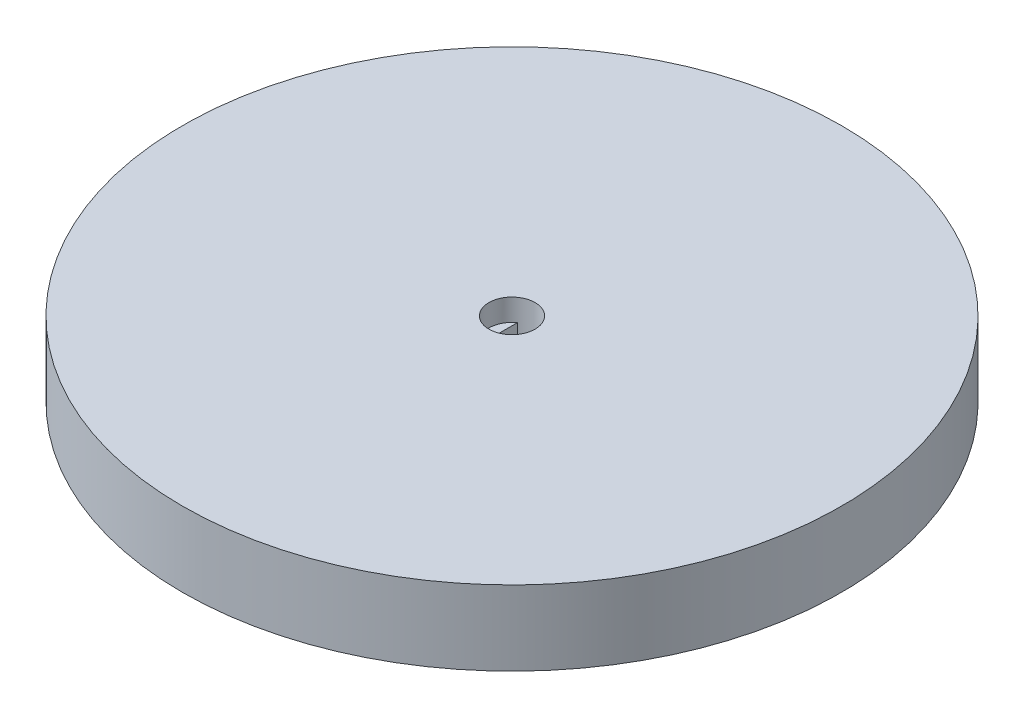
ISO-10303-21;
HEADER;
FILE_DESCRIPTION(('STEP AP214'),'2;1');
FILE_NAME('part.step','',(''),(''),'','','');
FILE_SCHEMA(('AUTOMOTIVE_DESIGN { 1 0 10303 214 1 1 1 1 }'));
ENDSEC;
DATA;
#1=APPLICATION_CONTEXT('core data for automotive mechanical design processes');
#2=APPLICATION_PROTOCOL_DEFINITION('international standard','automotive_design',2000,#1);
#3=PRODUCT_CONTEXT('',#1,'mechanical');
#4=PRODUCT('Part','Part','',(#3));
#5=PRODUCT_RELATED_PRODUCT_CATEGORY('part','',(#4));
#6=PRODUCT_DEFINITION_FORMATION('','',#4);
#7=PRODUCT_DEFINITION_CONTEXT('part definition',#1,'design');
#8=PRODUCT_DEFINITION('design','',#6,#7);
#9=PRODUCT_DEFINITION_SHAPE('','',#8);
#10=(LENGTH_UNIT() NAMED_UNIT(*) SI_UNIT(.MILLI.,.METRE.));
#11=(NAMED_UNIT(*) PLANE_ANGLE_UNIT() SI_UNIT($,.RADIAN.));
#12=(NAMED_UNIT(*) SI_UNIT($,.STERADIAN.) SOLID_ANGLE_UNIT());
#13=UNCERTAINTY_MEASURE_WITH_UNIT(LENGTH_MEASURE(1.E-05),#10,'distance_accuracy_value','');
#14=(GEOMETRIC_REPRESENTATION_CONTEXT(3) GLOBAL_UNCERTAINTY_ASSIGNED_CONTEXT((#13)) GLOBAL_UNIT_ASSIGNED_CONTEXT((#10,
#11,#12)) REPRESENTATION_CONTEXT('',''));
#15=CARTESIAN_POINT('',(0.,0.,0.));
#16=DIRECTION('',(0.,0.,1.));
#17=DIRECTION('',(1.,0.,0.));
#18=AXIS2_PLACEMENT_3D('',#15,#16,#17);
#19=CARTESIAN_POINT('',(0.,6.,0.));
#20=DIRECTION('',(0.,1.,0.));
#21=DIRECTION('',(0.,0.,1.));
#22=AXIS2_PLACEMENT_3D('',#19,#20,#21);
#23=PLANE('',#22);
#24=CARTESIAN_POINT('',(0.,6.,0.));
#25=DIRECTION('',(0.,1.,0.));
#26=DIRECTION('',(0.,0.,1.));
#27=AXIS2_PLACEMENT_3D('',#24,#25,#26);
#28=CIRCLE('',#27,2.625);
#29=CARTESIAN_POINT('',(1.525,6.,2.13658606192215));
#30=VERTEX_POINT('',#29);
#31=CARTESIAN_POINT('',(1.525,6.,-2.13658606192215));
#32=VERTEX_POINT('',#31);
#33=EDGE_CURVE('E125',#30,#32,#28,.T.);
#34=ORIENTED_EDGE('',*,*,#33,.T.);
#35=DIRECTION('',(0.,0.,1.));
#36=VECTOR('',#35,1.);
#37=CARTESIAN_POINT('',(1.525,6.,-2.13658606192215));
#38=LINE('',#37,#36);
#39=EDGE_CURVE('E105',#32,#30,#38,.T.);
#40=ORIENTED_EDGE('',*,*,#39,.T.);
#41=EDGE_LOOP('',(#34,#40));
#42=FACE_BOUND('',#41,.T.);
#43=ADVANCED_FACE('F39',(#42),#23,.T.);
#44=CARTESIAN_POINT('',(0.,8.5,0.));
#45=DIRECTION('',(0.,-1.,0.));
#46=DIRECTION('',(0.,0.,-1.));
#47=AXIS2_PLACEMENT_3D('',#44,#45,#46);
#48=CYLINDRICAL_SURFACE('',#47,37.5);
#49=CARTESIAN_POINT('',(0.,8.5,0.));
#50=DIRECTION('',(0.,1.,0.));
#51=DIRECTION('',(0.,0.,1.));
#52=AXIS2_PLACEMENT_3D('',#49,#50,#51);
#53=CIRCLE('',#52,37.5);
#54=CARTESIAN_POINT('',(0.,8.5,37.5));
#55=VERTEX_POINT('',#54);
#56=EDGE_CURVE('E11',#55,#55,#53,.T.);
#57=ORIENTED_EDGE('',*,*,#56,.F.);
#58=EDGE_LOOP('',(#57));
#59=FACE_BOUND('',#58,.T.);
#60=CARTESIAN_POINT('',(0.,0.,0.));
#61=DIRECTION('',(0.,1.,0.));
#62=DIRECTION('',(0.,0.,1.));
#63=AXIS2_PLACEMENT_3D('',#60,#61,#62);
#64=CIRCLE('',#63,37.5);
#65=CARTESIAN_POINT('',(0.,0.,37.5));
#66=VERTEX_POINT('',#65);
#67=EDGE_CURVE('E43',#66,#66,#64,.T.);
#68=ORIENTED_EDGE('',*,*,#67,.T.);
#69=EDGE_LOOP('',(#68));
#70=FACE_BOUND('',#69,.T.);
#71=ADVANCED_FACE('F41',(#59,#70),#48,.T.);
#72=CARTESIAN_POINT('',(0.,8.5,0.));
#73=DIRECTION('',(0.,1.,0.));
#74=DIRECTION('',(0.,0.,1.));
#75=AXIS2_PLACEMENT_3D('',#72,#73,#74);
#76=PLANE('',#75);
#77=CARTESIAN_POINT('',(0.,8.5,0.));
#78=DIRECTION('',(0.,1.,0.));
#79=DIRECTION('',(0.,0.,1.));
#80=AXIS2_PLACEMENT_3D('',#77,#78,#79);
#81=CIRCLE('',#80,2.625);
#82=CARTESIAN_POINT('',(0.,8.5,2.625));
#83=VERTEX_POINT('',#82);
#84=EDGE_CURVE('E119',#83,#83,#81,.T.);
#85=ORIENTED_EDGE('',*,*,#84,.F.);
#86=EDGE_LOOP('',(#85));
#87=FACE_BOUND('',#86,.T.);
#88=ORIENTED_EDGE('',*,*,#56,.T.);
#89=EDGE_LOOP('',(#88));
#90=FACE_BOUND('',#89,.T.);
#91=ADVANCED_FACE('F144',(#87,#90),#76,.T.);
#92=CARTESIAN_POINT('',(0.,0.,0.));
#93=DIRECTION('',(0.,1.,0.));
#94=DIRECTION('',(0.,0.,1.));
#95=AXIS2_PLACEMENT_3D('',#92,#93,#94);
#96=PLANE('',#95);
#97=CARTESIAN_POINT('',(0.,0.,0.));
#98=DIRECTION('',(0.,-1.,0.));
#99=DIRECTION('',(0.,0.,-1.));
#100=AXIS2_PLACEMENT_3D('',#97,#98,#99);
#101=CIRCLE('',#100,2.625);
#102=CARTESIAN_POINT('',(-1.525,0.,-2.13658606192215));
#103=VERTEX_POINT('',#102);
#104=CARTESIAN_POINT('',(1.525,0.,-2.13658606192215));
#105=VERTEX_POINT('',#104);
#106=EDGE_CURVE('E91',#103,#105,#101,.T.);
#107=ORIENTED_EDGE('',*,*,#106,.F.);
#108=DIRECTION('',(0.,0.,1.));
#109=VECTOR('',#108,1.);
#110=CARTESIAN_POINT('',(-1.525,0.,-2.13658606192215));
#111=LINE('',#110,#109);
#112=CARTESIAN_POINT('',(-1.525,0.,2.13658606192215));
#113=VERTEX_POINT('',#112);
#114=EDGE_CURVE('E84',#103,#113,#111,.T.);
#115=ORIENTED_EDGE('',*,*,#114,.T.);
#116=CARTESIAN_POINT('',(0.,0.,0.));
#117=DIRECTION('',(0.,1.,0.));
#118=DIRECTION('',(0.,0.,1.));
#119=AXIS2_PLACEMENT_3D('',#116,#117,#118);
#120=CIRCLE('',#119,2.625);
#121=CARTESIAN_POINT('',(1.525,0.,2.13658606192215));
#122=VERTEX_POINT('',#121);
#123=EDGE_CURVE('E94',#113,#122,#120,.T.);
#124=ORIENTED_EDGE('',*,*,#123,.T.);
#125=DIRECTION('',(0.,0.,1.));
#126=VECTOR('',#125,1.);
#127=CARTESIAN_POINT('',(1.525,0.,-2.13658606192215));
#128=LINE('',#127,#126);
#129=EDGE_CURVE('E100',#105,#122,#128,.T.);
#130=ORIENTED_EDGE('',*,*,#129,.F.);
#131=EDGE_LOOP('',(#107,#115,#124,#130));
#132=FACE_BOUND('',#131,.T.);
#133=ORIENTED_EDGE('',*,*,#67,.F.);
#134=EDGE_LOOP('',(#133));
#135=FACE_BOUND('',#134,.T.);
#136=ADVANCED_FACE('F102',(#132,#135),#96,.F.);
#137=CARTESIAN_POINT('',(0.,6.,0.));
#138=DIRECTION('',(0.,1.,0.));
#139=DIRECTION('',(0.,0.,1.));
#140=AXIS2_PLACEMENT_3D('',#137,#138,#139);
#141=CYLINDRICAL_SURFACE('',#140,2.625);
#142=ORIENTED_EDGE('',*,*,#33,.F.);
#143=DIRECTION('',(0.,1.,0.));
#144=VECTOR('',#143,1.);
#145=CARTESIAN_POINT('',(1.525,0.,2.13658606192215));
#146=LINE('',#145,#144);
#147=EDGE_CURVE('E55',#122,#30,#146,.T.);
#148=ORIENTED_EDGE('',*,*,#147,.F.);
#149=ORIENTED_EDGE('',*,*,#123,.F.);
#150=DIRECTION('',(0.,1.,0.));
#151=VECTOR('',#150,1.);
#152=CARTESIAN_POINT('',(-1.525,0.,2.13658606192215));
#153=LINE('',#152,#151);
#154=CARTESIAN_POINT('',(-1.525,6.,2.13658606192215));
#155=VERTEX_POINT('',#154);
#156=EDGE_CURVE('E81',#113,#155,#153,.T.);
#157=ORIENTED_EDGE('',*,*,#156,.T.);
#158=CARTESIAN_POINT('',(-1.525,6.,-2.13658606192215));
#159=VERTEX_POINT('',#158);
#160=EDGE_CURVE('E129',#159,#155,#28,.T.);
#161=ORIENTED_EDGE('',*,*,#160,.F.);
#162=DIRECTION('',(0.,1.,0.));
#163=VECTOR('',#162,1.);
#164=CARTESIAN_POINT('',(-1.525,0.,-2.13658606192215));
#165=LINE('',#164,#163);
#166=EDGE_CURVE('E116',#103,#159,#165,.T.);
#167=ORIENTED_EDGE('',*,*,#166,.F.);
#168=ORIENTED_EDGE('',*,*,#106,.T.);
#169=DIRECTION('',(0.,1.,0.));
#170=VECTOR('',#169,1.);
#171=CARTESIAN_POINT('',(1.525,0.,-2.13658606192215));
#172=LINE('',#171,#170);
#173=EDGE_CURVE('E120',#105,#32,#172,.T.);
#174=ORIENTED_EDGE('',*,*,#173,.T.);
#175=EDGE_LOOP('',(#142,#148,#149,#157,#161,#167,#168,#174));
#176=FACE_BOUND('',#175,.T.);
#177=ORIENTED_EDGE('',*,*,#84,.T.);
#178=EDGE_LOOP('',(#177));
#179=FACE_BOUND('',#178,.T.);
#180=ADVANCED_FACE('F95',(#176,#179),#141,.F.);
#181=DIRECTION('',(0.,0.,1.));
#182=VECTOR('',#181,1.);
#183=CARTESIAN_POINT('',(-1.525,6.,-2.13658606192215));
#184=LINE('',#183,#182);
#185=EDGE_CURVE('E87',#159,#155,#184,.T.);
#186=ORIENTED_EDGE('',*,*,#185,.F.);
#187=ORIENTED_EDGE('',*,*,#160,.T.);
#188=EDGE_LOOP('',(#186,#187));
#189=FACE_BOUND('',#188,.T.);
#190=ADVANCED_FACE('F135',(#189),#23,.T.);
#191=CARTESIAN_POINT('',(-1.525,0.,-2.13658606192215));
#192=DIRECTION('',(-1.,0.,0.));
#193=DIRECTION('',(0.,0.,1.));
#194=AXIS2_PLACEMENT_3D('',#191,#192,#193);
#195=PLANE('',#194);
#196=ORIENTED_EDGE('',*,*,#185,.T.);
#197=ORIENTED_EDGE('',*,*,#156,.F.);
#198=ORIENTED_EDGE('',*,*,#114,.F.);
#199=ORIENTED_EDGE('',*,*,#166,.T.);
#200=EDGE_LOOP('',(#196,#197,#198,#199));
#201=FACE_BOUND('',#200,.T.);
#202=ADVANCED_FACE('F82',(#201),#195,.F.);
#203=CARTESIAN_POINT('',(1.525,0.,-2.13658606192215));
#204=DIRECTION('',(-1.,0.,0.));
#205=DIRECTION('',(0.,0.,1.));
#206=AXIS2_PLACEMENT_3D('',#203,#204,#205);
#207=PLANE('',#206);
#208=ORIENTED_EDGE('',*,*,#39,.F.);
#209=ORIENTED_EDGE('',*,*,#173,.F.);
#210=ORIENTED_EDGE('',*,*,#129,.T.);
#211=ORIENTED_EDGE('',*,*,#147,.T.);
#212=EDGE_LOOP('',(#208,#209,#210,#211));
#213=FACE_BOUND('',#212,.T.);
#214=ADVANCED_FACE('F137',(#213),#207,.T.);
#215=CLOSED_SHELL('',(#43,#71,#91,#136,#180,#190,#202,#214));
#216=MANIFOLD_SOLID_BREP('B2',#215);
#217=ADVANCED_BREP_SHAPE_REPRESENTATION('',(#18,#216),#14);
#218=SHAPE_DEFINITION_REPRESENTATION(#9,#217);
ENDSEC;
END-ISO-10303-21;
